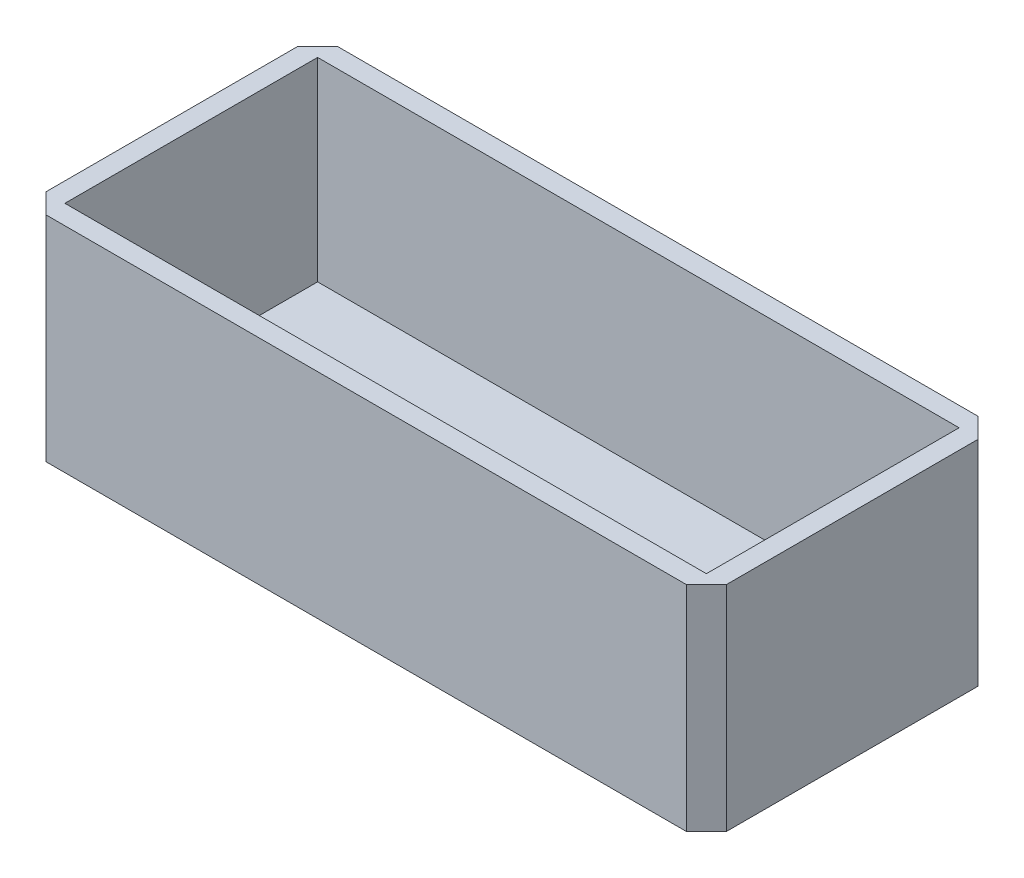
ISO-10303-21;
HEADER;
FILE_DESCRIPTION(('STEP AP214'),'2;1');
FILE_NAME('part.step','',(''),(''),'','','');
FILE_SCHEMA(('AUTOMOTIVE_DESIGN { 1 0 10303 214 1 1 1 1 }'));
ENDSEC;
DATA;
#1=APPLICATION_CONTEXT('core data for automotive mechanical design processes');
#2=APPLICATION_PROTOCOL_DEFINITION('international standard','automotive_design',2000,#1);
#3=PRODUCT_CONTEXT('',#1,'mechanical');
#4=PRODUCT('Part','Part','',(#3));
#5=PRODUCT_RELATED_PRODUCT_CATEGORY('part','',(#4));
#6=PRODUCT_DEFINITION_FORMATION('','',#4);
#7=PRODUCT_DEFINITION_CONTEXT('part definition',#1,'design');
#8=PRODUCT_DEFINITION('design','',#6,#7);
#9=PRODUCT_DEFINITION_SHAPE('','',#8);
#10=(LENGTH_UNIT() NAMED_UNIT(*) SI_UNIT(.MILLI.,.METRE.));
#11=(NAMED_UNIT(*) PLANE_ANGLE_UNIT() SI_UNIT($,.RADIAN.));
#12=(NAMED_UNIT(*) SI_UNIT($,.STERADIAN.) SOLID_ANGLE_UNIT());
#13=UNCERTAINTY_MEASURE_WITH_UNIT(LENGTH_MEASURE(1.E-05),#10,'distance_accuracy_value','');
#14=(GEOMETRIC_REPRESENTATION_CONTEXT(3) GLOBAL_UNCERTAINTY_ASSIGNED_CONTEXT((#13)) GLOBAL_UNIT_ASSIGNED_CONTEXT((#10,
#11,#12)) REPRESENTATION_CONTEXT('',''));
#15=CARTESIAN_POINT('',(0.,0.,0.));
#16=DIRECTION('',(0.,0.,1.));
#17=DIRECTION('',(1.,0.,0.));
#18=AXIS2_PLACEMENT_3D('',#15,#16,#17);
#19=CARTESIAN_POINT('',(0.,22.,0.));
#20=DIRECTION('',(0.,-1.,0.));
#21=DIRECTION('',(0.,0.,-1.));
#22=AXIS2_PLACEMENT_3D('',#19,#20,#21);
#23=PLANE('',#22);
#24=DIRECTION('',(0.,0.,1.));
#25=VECTOR('',#24,1.);
#26=CARTESIAN_POINT('',(2.,22.,0.));
#27=LINE('',#26,#25);
#28=CARTESIAN_POINT('',(2.,22.,-28.));
#29=VERTEX_POINT('',#28);
#30=CARTESIAN_POINT('',(2.,22.,-2.));
#31=VERTEX_POINT('',#30);
#32=EDGE_CURVE('E374',#29,#31,#27,.T.);
#33=ORIENTED_EDGE('',*,*,#32,.F.);
#34=DIRECTION('',(-1.,0.,0.));
#35=VECTOR('',#34,1.);
#36=CARTESIAN_POINT('',(0.,22.,-28.));
#37=LINE('',#36,#35);
#38=CARTESIAN_POINT('',(68.,22.,-28.));
#39=VERTEX_POINT('',#38);
#40=EDGE_CURVE('E359',#39,#29,#37,.T.);
#41=ORIENTED_EDGE('',*,*,#40,.F.);
#42=DIRECTION('',(0.,0.,-1.));
#43=VECTOR('',#42,1.);
#44=CARTESIAN_POINT('',(68.,22.,0.));
#45=LINE('',#44,#43);
#46=CARTESIAN_POINT('',(68.,22.,-2.));
#47=VERTEX_POINT('',#46);
#48=EDGE_CURVE('E380',#47,#39,#45,.T.);
#49=ORIENTED_EDGE('',*,*,#48,.F.);
#50=DIRECTION('',(1.,0.,0.));
#51=VECTOR('',#50,1.);
#52=CARTESIAN_POINT('',(0.,22.,-2.));
#53=LINE('',#52,#51);
#54=EDGE_CURVE('E377',#31,#47,#53,.T.);
#55=ORIENTED_EDGE('',*,*,#54,.F.);
#56=EDGE_LOOP('',(#33,#41,#49,#55));
#57=FACE_BOUND('',#56,.T.);
#58=DIRECTION('',(-1.,0.,0.));
#59=VECTOR('',#58,1.);
#60=CARTESIAN_POINT('',(0.,22.,-30.));
#61=LINE('',#60,#59);
#62=CARTESIAN_POINT('',(67.9431128335817,22.,-30.));
#63=VERTEX_POINT('',#62);
#64=CARTESIAN_POINT('',(2.05688716641831,22.,-30.));
#65=VERTEX_POINT('',#64);
#66=EDGE_CURVE('E11',#63,#65,#61,.T.);
#67=ORIENTED_EDGE('',*,*,#66,.T.);
#68=DIRECTION('',(0.707106781186549,0.,-0.707106781186546));
#69=VECTOR('',#68,1.);
#70=CARTESIAN_POINT('',(0.,22.,-27.9431128335817));
#71=LINE('',#70,#69);
#72=CARTESIAN_POINT('',(0.,22.,-27.9431128335817));
#73=VERTEX_POINT('',#72);
#74=EDGE_CURVE('E242',#73,#65,#71,.T.);
#75=ORIENTED_EDGE('',*,*,#74,.F.);
#76=DIRECTION('',(0.,0.,1.));
#77=VECTOR('',#76,1.);
#78=CARTESIAN_POINT('',(0.,22.,0.));
#79=LINE('',#78,#77);
#80=CARTESIAN_POINT('',(0.,22.,-2.05688716641831));
#81=VERTEX_POINT('',#80);
#82=EDGE_CURVE('E202',#73,#81,#79,.T.);
#83=ORIENTED_EDGE('',*,*,#82,.T.);
#84=DIRECTION('',(0.707106781186549,0.,0.707106781186546));
#85=VECTOR('',#84,1.);
#86=CARTESIAN_POINT('',(1.02844358320915,22.,-1.02844358320916));
#87=LINE('',#86,#85);
#88=CARTESIAN_POINT('',(2.05688716641831,22.,0.));
#89=VERTEX_POINT('',#88);
#90=EDGE_CURVE('E185',#81,#89,#87,.T.);
#91=ORIENTED_EDGE('',*,*,#90,.T.);
#92=DIRECTION('',(1.,0.,0.));
#93=VECTOR('',#92,1.);
#94=CARTESIAN_POINT('',(0.,22.,0.));
#95=LINE('',#94,#93);
#96=CARTESIAN_POINT('',(67.9431128335817,22.,0.));
#97=VERTEX_POINT('',#96);
#98=EDGE_CURVE('E193',#89,#97,#95,.T.);
#99=ORIENTED_EDGE('',*,*,#98,.T.);
#100=DIRECTION('',(-0.707106781186548,0.,0.707106781186548));
#101=VECTOR('',#100,1.);
#102=CARTESIAN_POINT('',(33.9715564167908,22.,33.9715564167908));
#103=LINE('',#102,#101);
#104=CARTESIAN_POINT('',(70.,22.,-2.05688716641832));
#105=VERTEX_POINT('',#104);
#106=EDGE_CURVE('E176',#105,#97,#103,.T.);
#107=ORIENTED_EDGE('',*,*,#106,.F.);
#108=DIRECTION('',(0.,0.,-1.));
#109=VECTOR('',#108,1.);
#110=CARTESIAN_POINT('',(70.,22.,0.));
#111=LINE('',#110,#109);
#112=CARTESIAN_POINT('',(70.,22.,-27.9431128335817));
#113=VERTEX_POINT('',#112);
#114=EDGE_CURVE('E48',#105,#113,#111,.T.);
#115=ORIENTED_EDGE('',*,*,#114,.T.);
#116=DIRECTION('',(-0.707106781186548,0.,-0.707106781186548));
#117=VECTOR('',#116,1.);
#118=CARTESIAN_POINT('',(48.9715564167908,22.,-48.9715564167908));
#119=LINE('',#118,#117);
#120=EDGE_CURVE('E197',#113,#63,#119,.T.);
#121=ORIENTED_EDGE('',*,*,#120,.T.);
#122=EDGE_LOOP('',(#67,#75,#83,#91,#99,#107,#115,#121));
#123=FACE_BOUND('',#122,.T.);
#124=ADVANCED_FACE('F38',(#57,#123),#23,.F.);
#125=CARTESIAN_POINT('',(0.,22.,0.));
#126=DIRECTION('',(1.,0.,0.));
#127=DIRECTION('',(0.,0.,-1.));
#128=AXIS2_PLACEMENT_3D('',#125,#126,#127);
#129=PLANE('',#128);
#130=ORIENTED_EDGE('',*,*,#82,.F.);
#131=DIRECTION('',(0.,1.,0.));
#132=VECTOR('',#131,1.);
#133=CARTESIAN_POINT('',(0.,0.,-27.9431128335817));
#134=LINE('',#133,#132);
#135=CARTESIAN_POINT('',(0.,0.,-27.9431128335817));
#136=VERTEX_POINT('',#135);
#137=EDGE_CURVE('E243',#136,#73,#134,.T.);
#138=ORIENTED_EDGE('',*,*,#137,.F.);
#139=DIRECTION('',(0.,0.,1.));
#140=VECTOR('',#139,1.);
#141=CARTESIAN_POINT('',(0.,0.,0.));
#142=LINE('',#141,#140);
#143=CARTESIAN_POINT('',(0.,0.,-2.05688716641831));
#144=VERTEX_POINT('',#143);
#145=EDGE_CURVE('E210',#136,#144,#142,.T.);
#146=ORIENTED_EDGE('',*,*,#145,.T.);
#147=DIRECTION('',(0.,1.,0.));
#148=VECTOR('',#147,1.);
#149=CARTESIAN_POINT('',(0.,0.,-2.05688716641831));
#150=LINE('',#149,#148);
#151=EDGE_CURVE('E254',#144,#81,#150,.T.);
#152=ORIENTED_EDGE('',*,*,#151,.T.);
#153=EDGE_LOOP('',(#130,#138,#146,#152));
#154=FACE_BOUND('',#153,.T.);
#155=ADVANCED_FACE('F40',(#154),#129,.F.);
#156=CARTESIAN_POINT('',(0.,22.,0.));
#157=DIRECTION('',(0.,0.,-1.));
#158=DIRECTION('',(-1.,0.,0.));
#159=AXIS2_PLACEMENT_3D('',#156,#157,#158);
#160=PLANE('',#159);
#161=DIRECTION('',(1.,0.,0.));
#162=VECTOR('',#161,1.);
#163=CARTESIAN_POINT('',(0.,0.,0.));
#164=LINE('',#163,#162);
#165=CARTESIAN_POINT('',(2.05688716641831,0.,0.));
#166=VERTEX_POINT('',#165);
#167=CARTESIAN_POINT('',(67.9431128335817,0.,0.));
#168=VERTEX_POINT('',#167);
#169=EDGE_CURVE('E195',#166,#168,#164,.T.);
#170=ORIENTED_EDGE('',*,*,#169,.T.);
#171=DIRECTION('',(0.,1.,0.));
#172=VECTOR('',#171,1.);
#173=CARTESIAN_POINT('',(67.9431128335817,0.,0.));
#174=LINE('',#173,#172);
#175=EDGE_CURVE('E56',#168,#97,#174,.T.);
#176=ORIENTED_EDGE('',*,*,#175,.T.);
#177=ORIENTED_EDGE('',*,*,#98,.F.);
#178=DIRECTION('',(0.,1.,0.));
#179=VECTOR('',#178,1.);
#180=CARTESIAN_POINT('',(2.05688716641831,0.,0.));
#181=LINE('',#180,#179);
#182=EDGE_CURVE('E257',#166,#89,#181,.T.);
#183=ORIENTED_EDGE('',*,*,#182,.F.);
#184=EDGE_LOOP('',(#170,#176,#177,#183));
#185=FACE_BOUND('',#184,.T.);
#186=ADVANCED_FACE('F191',(#185),#160,.F.);
#187=CARTESIAN_POINT('',(70.,22.,0.));
#188=DIRECTION('',(-1.,0.,0.));
#189=DIRECTION('',(0.,0.,1.));
#190=AXIS2_PLACEMENT_3D('',#187,#188,#189);
#191=PLANE('',#190);
#192=DIRECTION('',(0.,1.,0.));
#193=VECTOR('',#192,1.);
#194=CARTESIAN_POINT('',(70.,0.,-27.9431128335817));
#195=LINE('',#194,#193);
#196=CARTESIAN_POINT('',(70.,0.,-27.9431128335817));
#197=VERTEX_POINT('',#196);
#198=EDGE_CURVE('E64',#197,#113,#195,.T.);
#199=ORIENTED_EDGE('',*,*,#198,.T.);
#200=ORIENTED_EDGE('',*,*,#114,.F.);
#201=DIRECTION('',(0.,1.,0.));
#202=VECTOR('',#201,1.);
#203=CARTESIAN_POINT('',(70.,0.,-2.05688716641832));
#204=LINE('',#203,#202);
#205=CARTESIAN_POINT('',(70.,0.,-2.05688716641832));
#206=VERTEX_POINT('',#205);
#207=EDGE_CURVE('E179',#206,#105,#204,.T.);
#208=ORIENTED_EDGE('',*,*,#207,.F.);
#209=DIRECTION('',(0.,0.,-1.));
#210=VECTOR('',#209,1.);
#211=CARTESIAN_POINT('',(70.,0.,0.));
#212=LINE('',#211,#210);
#213=EDGE_CURVE('E216',#206,#197,#212,.T.);
#214=ORIENTED_EDGE('',*,*,#213,.T.);
#215=EDGE_LOOP('',(#199,#200,#208,#214));
#216=FACE_BOUND('',#215,.T.);
#217=ADVANCED_FACE('F433',(#216),#191,.F.);
#218=CARTESIAN_POINT('',(0.,22.,-30.));
#219=DIRECTION('',(0.,0.,1.));
#220=DIRECTION('',(1.,0.,0.));
#221=AXIS2_PLACEMENT_3D('',#218,#219,#220);
#222=PLANE('',#221);
#223=DIRECTION('',(-1.,0.,0.));
#224=VECTOR('',#223,1.);
#225=CARTESIAN_POINT('',(0.,0.,-30.));
#226=LINE('',#225,#224);
#227=CARTESIAN_POINT('',(67.9431128335817,0.,-30.));
#228=VERTEX_POINT('',#227);
#229=CARTESIAN_POINT('',(2.05688716641831,0.,-30.));
#230=VERTEX_POINT('',#229);
#231=EDGE_CURVE('E42',#228,#230,#226,.T.);
#232=ORIENTED_EDGE('',*,*,#231,.T.);
#233=DIRECTION('',(0.,1.,0.));
#234=VECTOR('',#233,1.);
#235=CARTESIAN_POINT('',(2.05688716641831,0.,-30.));
#236=LINE('',#235,#234);
#237=EDGE_CURVE('E229',#230,#65,#236,.T.);
#238=ORIENTED_EDGE('',*,*,#237,.T.);
#239=ORIENTED_EDGE('',*,*,#66,.F.);
#240=DIRECTION('',(0.,1.,0.));
#241=VECTOR('',#240,1.);
#242=CARTESIAN_POINT('',(67.9431128335817,0.,-30.));
#243=LINE('',#242,#241);
#244=EDGE_CURVE('E230',#228,#63,#243,.T.);
#245=ORIENTED_EDGE('',*,*,#244,.F.);
#246=EDGE_LOOP('',(#232,#238,#239,#245));
#247=FACE_BOUND('',#246,.T.);
#248=ADVANCED_FACE('F227',(#247),#222,.F.);
#249=CARTESIAN_POINT('',(0.,0.,0.));
#250=DIRECTION('',(0.,-1.,0.));
#251=DIRECTION('',(0.,0.,-1.));
#252=AXIS2_PLACEMENT_3D('',#249,#250,#251);
#253=PLANE('',#252);
#254=DIRECTION('',(0.707106781186549,0.,-0.707106781186546));
#255=VECTOR('',#254,1.);
#256=CARTESIAN_POINT('',(0.,0.,-27.9431128335817));
#257=LINE('',#256,#255);
#258=EDGE_CURVE('E237',#136,#230,#257,.T.);
#259=ORIENTED_EDGE('',*,*,#258,.T.);
#260=ORIENTED_EDGE('',*,*,#231,.F.);
#261=DIRECTION('',(-0.707106781186548,0.,-0.707106781186548));
#262=VECTOR('',#261,1.);
#263=CARTESIAN_POINT('',(48.9715564167908,0.,-48.9715564167908));
#264=LINE('',#263,#262);
#265=EDGE_CURVE('E235',#197,#228,#264,.T.);
#266=ORIENTED_EDGE('',*,*,#265,.F.);
#267=ORIENTED_EDGE('',*,*,#213,.F.);
#268=DIRECTION('',(-0.707106781186548,0.,0.707106781186548));
#269=VECTOR('',#268,1.);
#270=CARTESIAN_POINT('',(33.9715564167908,0.,33.9715564167908));
#271=LINE('',#270,#269);
#272=EDGE_CURVE('E186',#206,#168,#271,.T.);
#273=ORIENTED_EDGE('',*,*,#272,.T.);
#274=ORIENTED_EDGE('',*,*,#169,.F.);
#275=DIRECTION('',(0.707106781186549,0.,0.707106781186546));
#276=VECTOR('',#275,1.);
#277=CARTESIAN_POINT('',(1.02844358320915,0.,-1.02844358320916));
#278=LINE('',#277,#276);
#279=EDGE_CURVE('E251',#144,#166,#278,.T.);
#280=ORIENTED_EDGE('',*,*,#279,.F.);
#281=ORIENTED_EDGE('',*,*,#145,.F.);
#282=EDGE_LOOP('',(#259,#260,#266,#267,#273,#274,#280,#281));
#283=FACE_BOUND('',#282,.T.);
#284=CARTESIAN_POINT('',(10.,0.,-15.));
#285=DIRECTION('',(0.,-1.,0.));
#286=DIRECTION('',(0.,0.,-1.));
#287=AXIS2_PLACEMENT_3D('',#284,#285,#286);
#288=CIRCLE('',#287,2.);
#289=CARTESIAN_POINT('',(10.,0.,-13.));
#290=VERTEX_POINT('',#289);
#291=CARTESIAN_POINT('',(10.,0.,-17.));
#292=VERTEX_POINT('',#291);
#293=EDGE_CURVE('E342',#290,#292,#288,.T.);
#294=ORIENTED_EDGE('',*,*,#293,.F.);
#295=DIRECTION('',(-1.,0.,0.));
#296=VECTOR('',#295,1.);
#297=CARTESIAN_POINT('',(0.,0.,-13.));
#298=LINE('',#297,#296);
#299=CARTESIAN_POINT('',(20.,0.,-13.));
#300=VERTEX_POINT('',#299);
#301=EDGE_CURVE('E332',#300,#290,#298,.T.);
#302=ORIENTED_EDGE('',*,*,#301,.F.);
#303=CARTESIAN_POINT('',(20.,0.,-15.));
#304=DIRECTION('',(0.,-1.,0.));
#305=DIRECTION('',(0.,0.,-1.));
#306=AXIS2_PLACEMENT_3D('',#303,#304,#305);
#307=CIRCLE('',#306,2.);
#308=CARTESIAN_POINT('',(20.,0.,-17.));
#309=VERTEX_POINT('',#308);
#310=EDGE_CURVE('E335',#309,#300,#307,.T.);
#311=ORIENTED_EDGE('',*,*,#310,.F.);
#312=DIRECTION('',(1.,0.,0.));
#313=VECTOR('',#312,1.);
#314=CARTESIAN_POINT('',(0.,0.,-17.));
#315=LINE('',#314,#313);
#316=EDGE_CURVE('E339',#292,#309,#315,.T.);
#317=ORIENTED_EDGE('',*,*,#316,.F.);
#318=EDGE_LOOP('',(#294,#302,#311,#317));
#319=FACE_BOUND('',#318,.T.);
#320=CARTESIAN_POINT('',(60.,0.,-15.));
#321=DIRECTION('',(0.,-1.,0.));
#322=DIRECTION('',(0.,0.,-1.));
#323=AXIS2_PLACEMENT_3D('',#320,#321,#322);
#324=CIRCLE('',#323,1.99999999999999);
#325=CARTESIAN_POINT('',(60.,0.,-17.));
#326=VERTEX_POINT('',#325);
#327=CARTESIAN_POINT('',(60.,0.,-13.));
#328=VERTEX_POINT('',#327);
#329=EDGE_CURVE('E329',#326,#328,#324,.T.);
#330=ORIENTED_EDGE('',*,*,#329,.F.);
#331=DIRECTION('',(1.,0.,0.));
#332=VECTOR('',#331,1.);
#333=CARTESIAN_POINT('',(0.,0.,-17.));
#334=LINE('',#333,#332);
#335=CARTESIAN_POINT('',(50.,0.,-17.));
#336=VERTEX_POINT('',#335);
#337=EDGE_CURVE('E284',#336,#326,#334,.T.);
#338=ORIENTED_EDGE('',*,*,#337,.F.);
#339=CARTESIAN_POINT('',(50.,0.,-15.));
#340=DIRECTION('',(0.,-1.,0.));
#341=DIRECTION('',(0.,0.,-1.));
#342=AXIS2_PLACEMENT_3D('',#339,#340,#341);
#343=CIRCLE('',#342,1.99999999999999);
#344=CARTESIAN_POINT('',(50.,0.,-13.));
#345=VERTEX_POINT('',#344);
#346=EDGE_CURVE('E322',#345,#336,#343,.T.);
#347=ORIENTED_EDGE('',*,*,#346,.F.);
#348=DIRECTION('',(-1.,0.,0.));
#349=VECTOR('',#348,1.);
#350=CARTESIAN_POINT('',(0.,0.,-13.));
#351=LINE('',#350,#349);
#352=EDGE_CURVE('E326',#328,#345,#351,.T.);
#353=ORIENTED_EDGE('',*,*,#352,.F.);
#354=EDGE_LOOP('',(#330,#338,#347,#353));
#355=FACE_BOUND('',#354,.T.);
#356=ADVANCED_FACE('F233',(#283,#319,#355),#253,.T.);
#357=CARTESIAN_POINT('',(2.,22.,0.));
#358=DIRECTION('',(1.,0.,0.));
#359=DIRECTION('',(0.,0.,-1.));
#360=AXIS2_PLACEMENT_3D('',#357,#358,#359);
#361=PLANE('',#360);
#362=DIRECTION('',(0.,0.,1.));
#363=VECTOR('',#362,1.);
#364=CARTESIAN_POINT('',(2.,2.,0.));
#365=LINE('',#364,#363);
#366=CARTESIAN_POINT('',(2.,2.,-28.));
#367=VERTEX_POINT('',#366);
#368=CARTESIAN_POINT('',(2.,2.,-2.));
#369=VERTEX_POINT('',#368);
#370=EDGE_CURVE('E345',#367,#369,#365,.T.);
#371=ORIENTED_EDGE('',*,*,#370,.F.);
#372=DIRECTION('',(0.,-1.,0.));
#373=VECTOR('',#372,1.);
#374=CARTESIAN_POINT('',(2.,22.,-28.));
#375=LINE('',#374,#373);
#376=EDGE_CURVE('E354',#29,#367,#375,.T.);
#377=ORIENTED_EDGE('',*,*,#376,.F.);
#378=ORIENTED_EDGE('',*,*,#32,.T.);
#379=DIRECTION('',(0.,-1.,0.));
#380=VECTOR('',#379,1.);
#381=CARTESIAN_POINT('',(2.,22.,-2.));
#382=LINE('',#381,#380);
#383=EDGE_CURVE('E214',#31,#369,#382,.T.);
#384=ORIENTED_EDGE('',*,*,#383,.T.);
#385=EDGE_LOOP('',(#371,#377,#378,#384));
#386=FACE_BOUND('',#385,.T.);
#387=ADVANCED_FACE('F394',(#386),#361,.T.);
#388=CARTESIAN_POINT('',(0.,22.,-2.));
#389=DIRECTION('',(0.,0.,-1.));
#390=DIRECTION('',(-1.,0.,0.));
#391=AXIS2_PLACEMENT_3D('',#388,#389,#390);
#392=PLANE('',#391);
#393=DIRECTION('',(1.,0.,0.));
#394=VECTOR('',#393,1.);
#395=CARTESIAN_POINT('',(0.,2.,-2.));
#396=LINE('',#395,#394);
#397=CARTESIAN_POINT('',(68.,2.,-2.));
#398=VERTEX_POINT('',#397);
#399=EDGE_CURVE('E349',#369,#398,#396,.T.);
#400=ORIENTED_EDGE('',*,*,#399,.F.);
#401=ORIENTED_EDGE('',*,*,#383,.F.);
#402=ORIENTED_EDGE('',*,*,#54,.T.);
#403=DIRECTION('',(0.,-1.,0.));
#404=VECTOR('',#403,1.);
#405=CARTESIAN_POINT('',(68.,22.,-2.));
#406=LINE('',#405,#404);
#407=EDGE_CURVE('E353',#47,#398,#406,.T.);
#408=ORIENTED_EDGE('',*,*,#407,.T.);
#409=EDGE_LOOP('',(#400,#401,#402,#408));
#410=FACE_BOUND('',#409,.T.);
#411=ADVANCED_FACE('F399',(#410),#392,.T.);
#412=CARTESIAN_POINT('',(68.,22.,0.));
#413=DIRECTION('',(-1.,0.,0.));
#414=DIRECTION('',(0.,0.,1.));
#415=AXIS2_PLACEMENT_3D('',#412,#413,#414);
#416=PLANE('',#415);
#417=DIRECTION('',(0.,0.,-1.));
#418=VECTOR('',#417,1.);
#419=CARTESIAN_POINT('',(68.,2.,0.));
#420=LINE('',#419,#418);
#421=CARTESIAN_POINT('',(68.,2.,-28.));
#422=VERTEX_POINT('',#421);
#423=EDGE_CURVE('E362',#398,#422,#420,.T.);
#424=ORIENTED_EDGE('',*,*,#423,.F.);
#425=ORIENTED_EDGE('',*,*,#407,.F.);
#426=ORIENTED_EDGE('',*,*,#48,.T.);
#427=DIRECTION('',(0.,-1.,0.));
#428=VECTOR('',#427,1.);
#429=CARTESIAN_POINT('',(68.,22.,-28.));
#430=LINE('',#429,#428);
#431=EDGE_CURVE('E358',#39,#422,#430,.T.);
#432=ORIENTED_EDGE('',*,*,#431,.T.);
#433=EDGE_LOOP('',(#424,#425,#426,#432));
#434=FACE_BOUND('',#433,.T.);
#435=ADVANCED_FACE('F402',(#434),#416,.T.);
#436=CARTESIAN_POINT('',(0.,22.,-28.));
#437=DIRECTION('',(0.,0.,1.));
#438=DIRECTION('',(1.,0.,0.));
#439=AXIS2_PLACEMENT_3D('',#436,#437,#438);
#440=PLANE('',#439);
#441=DIRECTION('',(-1.,0.,0.));
#442=VECTOR('',#441,1.);
#443=CARTESIAN_POINT('',(0.,2.,-28.));
#444=LINE('',#443,#442);
#445=EDGE_CURVE('E368',#422,#367,#444,.T.);
#446=ORIENTED_EDGE('',*,*,#445,.F.);
#447=ORIENTED_EDGE('',*,*,#431,.F.);
#448=ORIENTED_EDGE('',*,*,#40,.T.);
#449=ORIENTED_EDGE('',*,*,#376,.T.);
#450=EDGE_LOOP('',(#446,#447,#448,#449));
#451=FACE_BOUND('',#450,.T.);
#452=ADVANCED_FACE('F388',(#451),#440,.T.);
#453=CARTESIAN_POINT('',(0.,2.,0.));
#454=DIRECTION('',(0.,-1.,0.));
#455=DIRECTION('',(0.,0.,-1.));
#456=AXIS2_PLACEMENT_3D('',#453,#454,#455);
#457=PLANE('',#456);
#458=DIRECTION('',(1.,0.,0.));
#459=VECTOR('',#458,1.);
#460=CARTESIAN_POINT('',(10.,2.,-13.));
#461=LINE('',#460,#459);
#462=CARTESIAN_POINT('',(10.,2.,-13.));
#463=VERTEX_POINT('',#462);
#464=CARTESIAN_POINT('',(20.,2.,-13.));
#465=VERTEX_POINT('',#464);
#466=EDGE_CURVE('E267',#463,#465,#461,.T.);
#467=ORIENTED_EDGE('',*,*,#466,.F.);
#468=CARTESIAN_POINT('',(10.,2.,-15.));
#469=DIRECTION('',(0.,1.,0.));
#470=DIRECTION('',(0.,0.,1.));
#471=AXIS2_PLACEMENT_3D('',#468,#469,#470);
#472=CIRCLE('',#471,2.);
#473=CARTESIAN_POINT('',(10.,2.,-17.));
#474=VERTEX_POINT('',#473);
#475=EDGE_CURVE('E264',#474,#463,#472,.T.);
#476=ORIENTED_EDGE('',*,*,#475,.F.);
#477=DIRECTION('',(-1.,0.,0.));
#478=VECTOR('',#477,1.);
#479=CARTESIAN_POINT('',(10.,2.,-17.));
#480=LINE('',#479,#478);
#481=CARTESIAN_POINT('',(20.,2.,-17.));
#482=VERTEX_POINT('',#481);
#483=EDGE_CURVE('E276',#482,#474,#480,.T.);
#484=ORIENTED_EDGE('',*,*,#483,.F.);
#485=CARTESIAN_POINT('',(20.,2.,-15.));
#486=DIRECTION('',(0.,1.,0.));
#487=DIRECTION('',(0.,0.,1.));
#488=AXIS2_PLACEMENT_3D('',#485,#486,#487);
#489=CIRCLE('',#488,2.);
#490=EDGE_CURVE('E272',#465,#482,#489,.T.);
#491=ORIENTED_EDGE('',*,*,#490,.F.);
#492=EDGE_LOOP('',(#467,#476,#484,#491));
#493=FACE_BOUND('',#492,.T.);
#494=DIRECTION('',(-1.,0.,0.));
#495=VECTOR('',#494,1.);
#496=CARTESIAN_POINT('',(60.,2.,-17.));
#497=LINE('',#496,#495);
#498=CARTESIAN_POINT('',(60.,2.,-17.));
#499=VERTEX_POINT('',#498);
#500=CARTESIAN_POINT('',(50.,2.,-17.));
#501=VERTEX_POINT('',#500);
#502=EDGE_CURVE('E296',#499,#501,#497,.T.);
#503=ORIENTED_EDGE('',*,*,#502,.F.);
#504=CARTESIAN_POINT('',(60.,2.,-15.));
#505=DIRECTION('',(0.,1.,0.));
#506=DIRECTION('',(0.,0.,-1.));
#507=AXIS2_PLACEMENT_3D('',#504,#505,#506);
#508=CIRCLE('',#507,1.99999999999999);
#509=CARTESIAN_POINT('',(60.,2.,-13.));
#510=VERTEX_POINT('',#509);
#511=EDGE_CURVE('E260',#510,#499,#508,.T.);
#512=ORIENTED_EDGE('',*,*,#511,.F.);
#513=DIRECTION('',(1.,0.,0.));
#514=VECTOR('',#513,1.);
#515=CARTESIAN_POINT('',(60.,2.,-13.));
#516=LINE('',#515,#514);
#517=CARTESIAN_POINT('',(50.,2.,-13.));
#518=VERTEX_POINT('',#517);
#519=EDGE_CURVE('E304',#518,#510,#516,.T.);
#520=ORIENTED_EDGE('',*,*,#519,.F.);
#521=CARTESIAN_POINT('',(50.,2.,-15.));
#522=DIRECTION('',(0.,1.,0.));
#523=DIRECTION('',(0.,0.,-1.));
#524=AXIS2_PLACEMENT_3D('',#521,#522,#523);
#525=CIRCLE('',#524,1.99999999999999);
#526=EDGE_CURVE('E300',#501,#518,#525,.T.);
#527=ORIENTED_EDGE('',*,*,#526,.F.);
#528=EDGE_LOOP('',(#503,#512,#520,#527));
#529=FACE_BOUND('',#528,.T.);
#530=ORIENTED_EDGE('',*,*,#370,.T.);
#531=ORIENTED_EDGE('',*,*,#399,.T.);
#532=ORIENTED_EDGE('',*,*,#423,.T.);
#533=ORIENTED_EDGE('',*,*,#445,.T.);
#534=EDGE_LOOP('',(#530,#531,#532,#533));
#535=FACE_BOUND('',#534,.T.);
#536=ADVANCED_FACE('F404',(#493,#529,#535),#457,.F.);
#537=CARTESIAN_POINT('',(60.,-20.,-15.));
#538=DIRECTION('',(0.,1.,0.));
#539=DIRECTION('',(0.,0.,1.));
#540=AXIS2_PLACEMENT_3D('',#537,#538,#539);
#541=CYLINDRICAL_SURFACE('',#540,1.99999999999999);
#542=ORIENTED_EDGE('',*,*,#329,.T.);
#543=DIRECTION('',(0.,1.,0.));
#544=VECTOR('',#543,1.);
#545=CARTESIAN_POINT('',(60.,-20.,-13.));
#546=LINE('',#545,#544);
#547=EDGE_CURVE('E268',#328,#510,#546,.T.);
#548=ORIENTED_EDGE('',*,*,#547,.T.);
#549=ORIENTED_EDGE('',*,*,#511,.T.);
#550=DIRECTION('',(0.,1.,0.));
#551=VECTOR('',#550,1.);
#552=CARTESIAN_POINT('',(60.,-20.,-17.));
#553=LINE('',#552,#551);
#554=EDGE_CURVE('E308',#326,#499,#553,.T.);
#555=ORIENTED_EDGE('',*,*,#554,.F.);
#556=EDGE_LOOP('',(#542,#548,#549,#555));
#557=FACE_BOUND('',#556,.T.);
#558=ADVANCED_FACE('F406',(#557),#541,.F.);
#559=CARTESIAN_POINT('',(60.,-20.,-13.));
#560=DIRECTION('',(0.,0.,1.));
#561=DIRECTION('',(1.,0.,0.));
#562=AXIS2_PLACEMENT_3D('',#559,#560,#561);
#563=PLANE('',#562);
#564=ORIENTED_EDGE('',*,*,#352,.T.);
#565=DIRECTION('',(0.,1.,0.));
#566=VECTOR('',#565,1.);
#567=CARTESIAN_POINT('',(50.,-20.,-13.));
#568=LINE('',#567,#566);
#569=EDGE_CURVE('E311',#345,#518,#568,.T.);
#570=ORIENTED_EDGE('',*,*,#569,.T.);
#571=ORIENTED_EDGE('',*,*,#519,.T.);
#572=ORIENTED_EDGE('',*,*,#547,.F.);
#573=EDGE_LOOP('',(#564,#570,#571,#572));
#574=FACE_BOUND('',#573,.T.);
#575=ADVANCED_FACE('F414',(#574),#563,.F.);
#576=CARTESIAN_POINT('',(50.,-20.,-15.));
#577=DIRECTION('',(0.,1.,0.));
#578=DIRECTION('',(0.,0.,1.));
#579=AXIS2_PLACEMENT_3D('',#576,#577,#578);
#580=CYLINDRICAL_SURFACE('',#579,1.99999999999999);
#581=ORIENTED_EDGE('',*,*,#346,.T.);
#582=DIRECTION('',(0.,1.,0.));
#583=VECTOR('',#582,1.);
#584=CARTESIAN_POINT('',(50.,-20.,-17.));
#585=LINE('',#584,#583);
#586=EDGE_CURVE('E314',#336,#501,#585,.T.);
#587=ORIENTED_EDGE('',*,*,#586,.T.);
#588=ORIENTED_EDGE('',*,*,#526,.T.);
#589=ORIENTED_EDGE('',*,*,#569,.F.);
#590=EDGE_LOOP('',(#581,#587,#588,#589));
#591=FACE_BOUND('',#590,.T.);
#592=ADVANCED_FACE('F514',(#591),#580,.F.);
#593=CARTESIAN_POINT('',(60.,-20.,-17.));
#594=DIRECTION('',(0.,0.,-1.));
#595=DIRECTION('',(-1.,0.,0.));
#596=AXIS2_PLACEMENT_3D('',#593,#594,#595);
#597=PLANE('',#596);
#598=ORIENTED_EDGE('',*,*,#337,.T.);
#599=ORIENTED_EDGE('',*,*,#554,.T.);
#600=ORIENTED_EDGE('',*,*,#502,.T.);
#601=ORIENTED_EDGE('',*,*,#586,.F.);
#602=EDGE_LOOP('',(#598,#599,#600,#601));
#603=FACE_BOUND('',#602,.T.);
#604=ADVANCED_FACE('F510',(#603),#597,.F.);
#605=CARTESIAN_POINT('',(10.,-20.,-15.));
#606=DIRECTION('',(0.,1.,0.));
#607=DIRECTION('',(0.,0.,1.));
#608=AXIS2_PLACEMENT_3D('',#605,#606,#607);
#609=CYLINDRICAL_SURFACE('',#608,2.);
#610=ORIENTED_EDGE('',*,*,#293,.T.);
#611=DIRECTION('',(0.,1.,0.));
#612=VECTOR('',#611,1.);
#613=CARTESIAN_POINT('',(10.,-20.,-17.));
#614=LINE('',#613,#612);
#615=EDGE_CURVE('E281',#292,#474,#614,.T.);
#616=ORIENTED_EDGE('',*,*,#615,.T.);
#617=ORIENTED_EDGE('',*,*,#475,.T.);
#618=DIRECTION('',(0.,1.,0.));
#619=VECTOR('',#618,1.);
#620=CARTESIAN_POINT('',(10.,-20.,-13.));
#621=LINE('',#620,#619);
#622=EDGE_CURVE('E280',#290,#463,#621,.T.);
#623=ORIENTED_EDGE('',*,*,#622,.F.);
#624=EDGE_LOOP('',(#610,#616,#617,#623));
#625=FACE_BOUND('',#624,.T.);
#626=ADVANCED_FACE('F501',(#625),#609,.F.);
#627=CARTESIAN_POINT('',(10.,-20.,-17.));
#628=DIRECTION('',(0.,0.,-1.));
#629=DIRECTION('',(-1.,0.,0.));
#630=AXIS2_PLACEMENT_3D('',#627,#628,#629);
#631=PLANE('',#630);
#632=ORIENTED_EDGE('',*,*,#316,.T.);
#633=DIRECTION('',(0.,1.,0.));
#634=VECTOR('',#633,1.);
#635=CARTESIAN_POINT('',(20.,-20.,-17.));
#636=LINE('',#635,#634);
#637=EDGE_CURVE('E285',#309,#482,#636,.T.);
#638=ORIENTED_EDGE('',*,*,#637,.T.);
#639=ORIENTED_EDGE('',*,*,#483,.T.);
#640=ORIENTED_EDGE('',*,*,#615,.F.);
#641=EDGE_LOOP('',(#632,#638,#639,#640));
#642=FACE_BOUND('',#641,.T.);
#643=ADVANCED_FACE('F497',(#642),#631,.F.);
#644=CARTESIAN_POINT('',(20.,-20.,-15.));
#645=DIRECTION('',(0.,1.,0.));
#646=DIRECTION('',(0.,0.,1.));
#647=AXIS2_PLACEMENT_3D('',#644,#645,#646);
#648=CYLINDRICAL_SURFACE('',#647,2.);
#649=ORIENTED_EDGE('',*,*,#310,.T.);
#650=DIRECTION('',(0.,1.,0.));
#651=VECTOR('',#650,1.);
#652=CARTESIAN_POINT('',(20.,-20.,-13.));
#653=LINE('',#652,#651);
#654=EDGE_CURVE('E288',#300,#465,#653,.T.);
#655=ORIENTED_EDGE('',*,*,#654,.T.);
#656=ORIENTED_EDGE('',*,*,#490,.T.);
#657=ORIENTED_EDGE('',*,*,#637,.F.);
#658=EDGE_LOOP('',(#649,#655,#656,#657));
#659=FACE_BOUND('',#658,.T.);
#660=ADVANCED_FACE('F500',(#659),#648,.F.);
#661=CARTESIAN_POINT('',(10.,-20.,-13.));
#662=DIRECTION('',(0.,0.,1.));
#663=DIRECTION('',(1.,0.,0.));
#664=AXIS2_PLACEMENT_3D('',#661,#662,#663);
#665=PLANE('',#664);
#666=ORIENTED_EDGE('',*,*,#301,.T.);
#667=ORIENTED_EDGE('',*,*,#622,.T.);
#668=ORIENTED_EDGE('',*,*,#466,.T.);
#669=ORIENTED_EDGE('',*,*,#654,.F.);
#670=EDGE_LOOP('',(#666,#667,#668,#669));
#671=FACE_BOUND('',#670,.T.);
#672=ADVANCED_FACE('F463',(#671),#665,.F.);
#673=CARTESIAN_POINT('',(1.02844358320915,0.,-1.02844358320916));
#674=DIRECTION('',(-0.707106781186546,0.,0.707106781186549));
#675=DIRECTION('',(0.707106781186549,0.,0.707106781186546));
#676=AXIS2_PLACEMENT_3D('',#673,#674,#675);
#677=PLANE('',#676);
#678=ORIENTED_EDGE('',*,*,#90,.F.);
#679=ORIENTED_EDGE('',*,*,#151,.F.);
#680=ORIENTED_EDGE('',*,*,#279,.T.);
#681=ORIENTED_EDGE('',*,*,#182,.T.);
#682=EDGE_LOOP('',(#678,#679,#680,#681));
#683=FACE_BOUND('',#682,.T.);
#684=ADVANCED_FACE('F458',(#683),#677,.T.);
#685=CARTESIAN_POINT('',(33.9715564167908,0.,33.9715564167908));
#686=DIRECTION('',(-0.707106781186548,0.,-0.707106781186548));
#687=DIRECTION('',(-0.707106781186548,0.,0.707106781186548));
#688=AXIS2_PLACEMENT_3D('',#685,#686,#687);
#689=PLANE('',#688);
#690=ORIENTED_EDGE('',*,*,#106,.T.);
#691=ORIENTED_EDGE('',*,*,#175,.F.);
#692=ORIENTED_EDGE('',*,*,#272,.F.);
#693=ORIENTED_EDGE('',*,*,#207,.T.);
#694=EDGE_LOOP('',(#690,#691,#692,#693));
#695=FACE_BOUND('',#694,.T.);
#696=ADVANCED_FACE('F177',(#695),#689,.F.);
#697=CARTESIAN_POINT('',(48.9715564167908,0.,-48.9715564167908));
#698=DIRECTION('',(0.707106781186548,0.,-0.707106781186548));
#699=DIRECTION('',(-0.707106781186548,0.,-0.707106781186548));
#700=AXIS2_PLACEMENT_3D('',#697,#698,#699);
#701=PLANE('',#700);
#702=ORIENTED_EDGE('',*,*,#120,.F.);
#703=ORIENTED_EDGE('',*,*,#198,.F.);
#704=ORIENTED_EDGE('',*,*,#265,.T.);
#705=ORIENTED_EDGE('',*,*,#244,.T.);
#706=EDGE_LOOP('',(#702,#703,#704,#705));
#707=FACE_BOUND('',#706,.T.);
#708=ADVANCED_FACE('F475',(#707),#701,.T.);
#709=CARTESIAN_POINT('',(0.,0.,-27.9431128335817));
#710=DIRECTION('',(0.707106781186546,0.,0.707106781186549));
#711=DIRECTION('',(0.707106781186549,0.,-0.707106781186546));
#712=AXIS2_PLACEMENT_3D('',#709,#710,#711);
#713=PLANE('',#712);
#714=ORIENTED_EDGE('',*,*,#74,.T.);
#715=ORIENTED_EDGE('',*,*,#237,.F.);
#716=ORIENTED_EDGE('',*,*,#258,.F.);
#717=ORIENTED_EDGE('',*,*,#137,.T.);
#718=EDGE_LOOP('',(#714,#715,#716,#717));
#719=FACE_BOUND('',#718,.T.);
#720=ADVANCED_FACE('F484',(#719),#713,.F.);
#721=CLOSED_SHELL('',(#124,#155,#186,#217,#248,#356,#387,#411,#435,#452,#536,#558,#575,#592,
#604,#626,#643,#660,#672,#684,#696,#708,#720));
#722=MANIFOLD_SOLID_BREP('B2',#721);
#723=ADVANCED_BREP_SHAPE_REPRESENTATION('',(#18,#722),#14);
#724=SHAPE_DEFINITION_REPRESENTATION(#9,#723);
ENDSEC;
END-ISO-10303-21;
